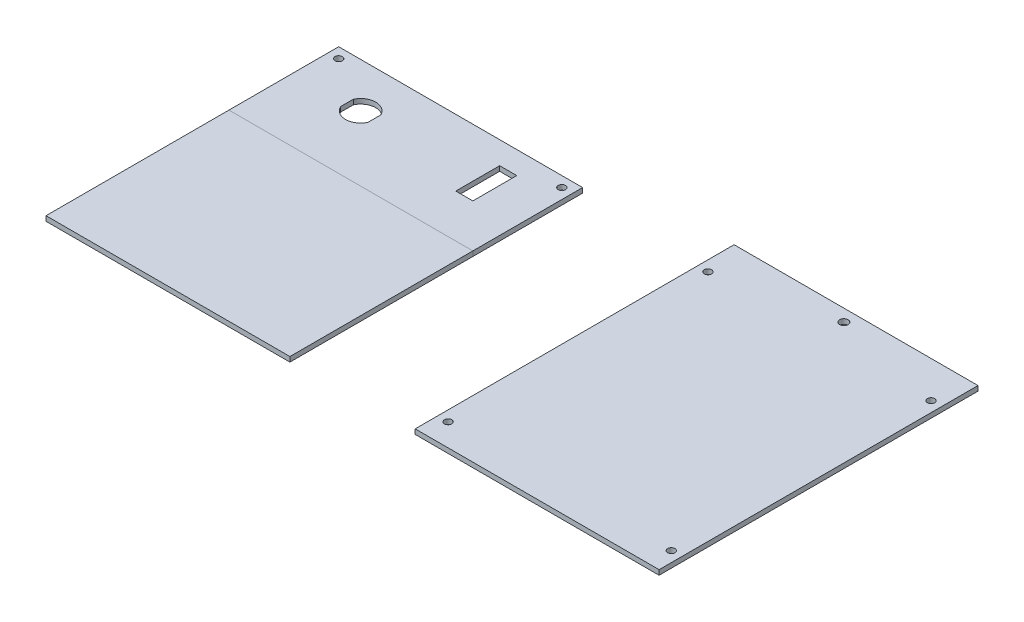
ISO-10303-21;
HEADER;
FILE_DESCRIPTION(('STEP AP214'),'2;1');
FILE_NAME('part.step','',(''),(''),'','','');
FILE_SCHEMA(('AUTOMOTIVE_DESIGN { 1 0 10303 214 1 1 1 1 }'));
ENDSEC;
DATA;
#1=APPLICATION_CONTEXT('core data for automotive mechanical design processes');
#2=APPLICATION_PROTOCOL_DEFINITION('international standard','automotive_design',2000,#1);
#3=PRODUCT_CONTEXT('',#1,'mechanical');
#4=PRODUCT('Part','Part','',(#3));
#5=PRODUCT_RELATED_PRODUCT_CATEGORY('part','',(#4));
#6=PRODUCT_DEFINITION_FORMATION('','',#4);
#7=PRODUCT_DEFINITION_CONTEXT('part definition',#1,'design');
#8=PRODUCT_DEFINITION('design','',#6,#7);
#9=PRODUCT_DEFINITION_SHAPE('','',#8);
#10=(LENGTH_UNIT() NAMED_UNIT(*) SI_UNIT(.MILLI.,.METRE.));
#11=(NAMED_UNIT(*) PLANE_ANGLE_UNIT() SI_UNIT($,.RADIAN.));
#12=(NAMED_UNIT(*) SI_UNIT($,.STERADIAN.) SOLID_ANGLE_UNIT());
#13=UNCERTAINTY_MEASURE_WITH_UNIT(LENGTH_MEASURE(1.E-05),#10,'distance_accuracy_value','');
#14=(GEOMETRIC_REPRESENTATION_CONTEXT(3) GLOBAL_UNCERTAINTY_ASSIGNED_CONTEXT((#13)) GLOBAL_UNIT_ASSIGNED_CONTEXT((#10,
#11,#12)) REPRESENTATION_CONTEXT('',''));
#15=CARTESIAN_POINT('',(0.,0.,0.));
#16=DIRECTION('',(0.,0.,1.));
#17=DIRECTION('',(1.,0.,0.));
#18=AXIS2_PLACEMENT_3D('',#15,#16,#17);
#19=CARTESIAN_POINT('',(100.,2.,0.));
#20=DIRECTION('',(1.,0.,0.));
#21=DIRECTION('',(0.,0.,-1.));
#22=AXIS2_PLACEMENT_3D('',#19,#20,#21);
#23=PLANE('',#22);
#24=DIRECTION('',(0.,0.,1.));
#25=VECTOR('',#24,1.);
#26=CARTESIAN_POINT('',(100.,0.,0.));
#27=LINE('',#26,#25);
#28=CARTESIAN_POINT('',(100.,0.,0.));
#29=VERTEX_POINT('',#28);
#30=CARTESIAN_POINT('',(100.,0.,75.));
#31=VERTEX_POINT('',#30);
#32=EDGE_CURVE('E109',#29,#31,#27,.T.);
#33=ORIENTED_EDGE('',*,*,#32,.F.);
#34=DIRECTION('',(0.,-1.,0.));
#35=VECTOR('',#34,1.);
#36=CARTESIAN_POINT('',(100.,2.,0.));
#37=LINE('',#36,#35);
#38=CARTESIAN_POINT('',(100.,2.,0.));
#39=VERTEX_POINT('',#38);
#40=EDGE_CURVE('E12',#39,#29,#37,.T.);
#41=ORIENTED_EDGE('',*,*,#40,.F.);
#42=DIRECTION('',(0.,0.,1.));
#43=VECTOR('',#42,1.);
#44=CARTESIAN_POINT('',(100.,2.,0.));
#45=LINE('',#44,#43);
#46=CARTESIAN_POINT('',(100.,2.,75.));
#47=VERTEX_POINT('',#46);
#48=EDGE_CURVE('E103',#39,#47,#45,.T.);
#49=ORIENTED_EDGE('',*,*,#48,.T.);
#50=DIRECTION('',(0.,-1.,0.));
#51=VECTOR('',#50,1.);
#52=CARTESIAN_POINT('',(100.,2.,75.));
#53=LINE('',#52,#51);
#54=EDGE_CURVE('E84',#47,#31,#53,.T.);
#55=ORIENTED_EDGE('',*,*,#54,.T.);
#56=EDGE_LOOP('',(#33,#41,#49,#55));
#57=FACE_BOUND('',#56,.T.);
#58=ADVANCED_FACE('F46',(#57),#23,.T.);
#59=CARTESIAN_POINT('',(0.,2.,0.));
#60=DIRECTION('',(0.,0.,-1.));
#61=DIRECTION('',(-1.,0.,0.));
#62=AXIS2_PLACEMENT_3D('',#59,#60,#61);
#63=PLANE('',#62);
#64=DIRECTION('',(1.,0.,0.));
#65=VECTOR('',#64,1.);
#66=CARTESIAN_POINT('',(0.,0.,0.));
#67=LINE('',#66,#65);
#68=CARTESIAN_POINT('',(0.,0.,0.));
#69=VERTEX_POINT('',#68);
#70=EDGE_CURVE('E97',#69,#29,#67,.T.);
#71=ORIENTED_EDGE('',*,*,#70,.F.);
#72=DIRECTION('',(0.,-1.,0.));
#73=VECTOR('',#72,1.);
#74=CARTESIAN_POINT('',(0.,2.,0.));
#75=LINE('',#74,#73);
#76=CARTESIAN_POINT('',(0.,2.,0.));
#77=VERTEX_POINT('',#76);
#78=EDGE_CURVE('E54',#77,#69,#75,.T.);
#79=ORIENTED_EDGE('',*,*,#78,.F.);
#80=DIRECTION('',(1.,0.,0.));
#81=VECTOR('',#80,1.);
#82=CARTESIAN_POINT('',(0.,2.,0.));
#83=LINE('',#82,#81);
#84=EDGE_CURVE('E95',#77,#39,#83,.T.);
#85=ORIENTED_EDGE('',*,*,#84,.T.);
#86=ORIENTED_EDGE('',*,*,#40,.T.);
#87=EDGE_LOOP('',(#71,#79,#85,#86));
#88=FACE_BOUND('',#87,.T.);
#89=ADVANCED_FACE('F93',(#88),#63,.T.);
#90=CARTESIAN_POINT('',(0.,2.,0.));
#91=DIRECTION('',(1.,0.,0.));
#92=DIRECTION('',(0.,0.,-1.));
#93=AXIS2_PLACEMENT_3D('',#90,#91,#92);
#94=PLANE('',#93);
#95=DIRECTION('',(0.,0.,1.));
#96=VECTOR('',#95,1.);
#97=CARTESIAN_POINT('',(0.,0.,0.));
#98=LINE('',#97,#96);
#99=CARTESIAN_POINT('',(0.,0.,75.));
#100=VERTEX_POINT('',#99);
#101=EDGE_CURVE('E77',#69,#100,#98,.T.);
#102=ORIENTED_EDGE('',*,*,#101,.T.);
#103=DIRECTION('',(0.,-1.,0.));
#104=VECTOR('',#103,1.);
#105=CARTESIAN_POINT('',(0.,2.,75.));
#106=LINE('',#105,#104);
#107=CARTESIAN_POINT('',(0.,2.,75.));
#108=VERTEX_POINT('',#107);
#109=EDGE_CURVE('E98',#108,#100,#106,.T.);
#110=ORIENTED_EDGE('',*,*,#109,.F.);
#111=DIRECTION('',(0.,0.,1.));
#112=VECTOR('',#111,1.);
#113=CARTESIAN_POINT('',(0.,2.,0.));
#114=LINE('',#113,#112);
#115=EDGE_CURVE('E99',#77,#108,#114,.T.);
#116=ORIENTED_EDGE('',*,*,#115,.F.);
#117=ORIENTED_EDGE('',*,*,#78,.T.);
#118=EDGE_LOOP('',(#102,#110,#116,#117));
#119=FACE_BOUND('',#118,.T.);
#120=ADVANCED_FACE('F100',(#119),#94,.F.);
#121=CARTESIAN_POINT('',(0.,2.,75.));
#122=DIRECTION('',(0.,0.,-1.));
#123=DIRECTION('',(-1.,0.,0.));
#124=AXIS2_PLACEMENT_3D('',#121,#122,#123);
#125=PLANE('',#124);
#126=DIRECTION('',(1.,0.,0.));
#127=VECTOR('',#126,1.);
#128=CARTESIAN_POINT('',(0.,0.,75.));
#129=LINE('',#128,#127);
#130=EDGE_CURVE('E105',#100,#31,#129,.T.);
#131=ORIENTED_EDGE('',*,*,#130,.T.);
#132=ORIENTED_EDGE('',*,*,#54,.F.);
#133=DIRECTION('',(1.,0.,0.));
#134=VECTOR('',#133,1.);
#135=CARTESIAN_POINT('',(0.,2.,75.));
#136=LINE('',#135,#134);
#137=EDGE_CURVE('E62',#108,#47,#136,.T.);
#138=ORIENTED_EDGE('',*,*,#137,.F.);
#139=ORIENTED_EDGE('',*,*,#109,.T.);
#140=EDGE_LOOP('',(#131,#132,#138,#139));
#141=FACE_BOUND('',#140,.T.);
#142=ADVANCED_FACE('F118',(#141),#125,.F.);
#143=CARTESIAN_POINT('',(0.,2.,0.));
#144=DIRECTION('',(0.,1.,0.));
#145=DIRECTION('',(0.,0.,1.));
#146=AXIS2_PLACEMENT_3D('',#143,#144,#145);
#147=PLANE('',#146);
#148=ORIENTED_EDGE('',*,*,#48,.F.);
#149=ORIENTED_EDGE('',*,*,#84,.F.);
#150=ORIENTED_EDGE('',*,*,#115,.T.);
#151=ORIENTED_EDGE('',*,*,#137,.T.);
#152=EDGE_LOOP('',(#148,#149,#150,#151));
#153=FACE_BOUND('',#152,.T.);
#154=ADVANCED_FACE('F102',(#153),#147,.T.);
#155=CARTESIAN_POINT('',(0.,0.,0.));
#156=DIRECTION('',(0.,1.,0.));
#157=DIRECTION('',(0.,0.,1.));
#158=AXIS2_PLACEMENT_3D('',#155,#156,#157);
#159=PLANE('',#158);
#160=ORIENTED_EDGE('',*,*,#32,.T.);
#161=ORIENTED_EDGE('',*,*,#130,.F.);
#162=ORIENTED_EDGE('',*,*,#101,.F.);
#163=ORIENTED_EDGE('',*,*,#70,.T.);
#164=EDGE_LOOP('',(#160,#161,#162,#163));
#165=FACE_BOUND('',#164,.T.);
#166=ADVANCED_FACE('F120',(#165),#159,.F.);
#167=CLOSED_SHELL('',(#58,#89,#120,#142,#154,#166));
#168=MANIFOLD_SOLID_BREP('B2',#167);
#169=CARTESIAN_POINT('',(0.,2.,-35.75));
#170=DIRECTION('',(0.,0.,-1.));
#171=DIRECTION('',(-1.,0.,0.));
#172=AXIS2_PLACEMENT_3D('',#169,#170,#171);
#173=PLANE('',#172);
#174=DIRECTION('',(1.,0.,0.));
#175=VECTOR('',#174,1.);
#176=CARTESIAN_POINT('',(0.,0.,-35.75));
#177=LINE('',#176,#175);
#178=CARTESIAN_POINT('',(75.25,0.,-35.75));
#179=VERTEX_POINT('',#178);
#180=CARTESIAN_POINT('',(82.25,0.,-35.75));
#181=VERTEX_POINT('',#180);
#182=EDGE_CURVE('E332',#179,#181,#177,.T.);
#183=ORIENTED_EDGE('',*,*,#182,.T.);
#184=DIRECTION('',(0.,-1.,0.));
#185=VECTOR('',#184,1.);
#186=CARTESIAN_POINT('',(82.25,2.,-35.75));
#187=LINE('',#186,#185);
#188=CARTESIAN_POINT('',(82.25,2.,-35.75));
#189=VERTEX_POINT('',#188);
#190=EDGE_CURVE('E44',#189,#181,#187,.T.);
#191=ORIENTED_EDGE('',*,*,#190,.F.);
#192=DIRECTION('',(1.,0.,0.));
#193=VECTOR('',#192,1.);
#194=CARTESIAN_POINT('',(0.,2.,-35.75));
#195=LINE('',#194,#193);
#196=CARTESIAN_POINT('',(75.25,2.,-35.75));
#197=VERTEX_POINT('',#196);
#198=EDGE_CURVE('E285',#197,#189,#195,.T.);
#199=ORIENTED_EDGE('',*,*,#198,.F.);
#200=DIRECTION('',(0.,-1.,0.));
#201=VECTOR('',#200,1.);
#202=CARTESIAN_POINT('',(75.25,2.,-35.75));
#203=LINE('',#202,#201);
#204=EDGE_CURVE('E201',#197,#179,#203,.T.);
#205=ORIENTED_EDGE('',*,*,#204,.T.);
#206=EDGE_LOOP('',(#183,#191,#199,#205));
#207=FACE_BOUND('',#206,.T.);
#208=ADVANCED_FACE('F182',(#207),#173,.F.);
#209=CARTESIAN_POINT('',(82.25,2.,0.));
#210=DIRECTION('',(1.,0.,0.));
#211=DIRECTION('',(0.,0.,-1.));
#212=AXIS2_PLACEMENT_3D('',#209,#210,#211);
#213=PLANE('',#212);
#214=DIRECTION('',(0.,0.,1.));
#215=VECTOR('',#214,1.);
#216=CARTESIAN_POINT('',(82.25,0.,0.));
#217=LINE('',#216,#215);
#218=CARTESIAN_POINT('',(82.25,0.,-17.75));
#219=VERTEX_POINT('',#218);
#220=EDGE_CURVE('E291',#181,#219,#217,.T.);
#221=ORIENTED_EDGE('',*,*,#220,.T.);
#222=DIRECTION('',(0.,-1.,0.));
#223=VECTOR('',#222,1.);
#224=CARTESIAN_POINT('',(82.25,2.,-17.75));
#225=LINE('',#224,#223);
#226=CARTESIAN_POINT('',(82.25,2.,-17.75));
#227=VERTEX_POINT('',#226);
#228=EDGE_CURVE('E192',#227,#219,#225,.T.);
#229=ORIENTED_EDGE('',*,*,#228,.F.);
#230=DIRECTION('',(0.,0.,1.));
#231=VECTOR('',#230,1.);
#232=CARTESIAN_POINT('',(82.25,2.,0.));
#233=LINE('',#232,#231);
#234=EDGE_CURVE('E279',#189,#227,#233,.T.);
#235=ORIENTED_EDGE('',*,*,#234,.F.);
#236=ORIENTED_EDGE('',*,*,#190,.T.);
#237=EDGE_LOOP('',(#221,#229,#235,#236));
#238=FACE_BOUND('',#237,.T.);
#239=ADVANCED_FACE('F290',(#238),#213,.F.);
#240=CARTESIAN_POINT('',(0.,2.,-17.75));
#241=DIRECTION('',(0.,0.,-1.));
#242=DIRECTION('',(-1.,0.,0.));
#243=AXIS2_PLACEMENT_3D('',#240,#241,#242);
#244=PLANE('',#243);
#245=DIRECTION('',(1.,0.,0.));
#246=VECTOR('',#245,1.);
#247=CARTESIAN_POINT('',(0.,0.,-17.75));
#248=LINE('',#247,#246);
#249=CARTESIAN_POINT('',(75.25,0.,-17.75));
#250=VERTEX_POINT('',#249);
#251=EDGE_CURVE('E335',#250,#219,#248,.T.);
#252=ORIENTED_EDGE('',*,*,#251,.F.);
#253=DIRECTION('',(0.,-1.,0.));
#254=VECTOR('',#253,1.);
#255=CARTESIAN_POINT('',(75.25,2.,-17.75));
#256=LINE('',#255,#254);
#257=CARTESIAN_POINT('',(75.25,2.,-17.75));
#258=VERTEX_POINT('',#257);
#259=EDGE_CURVE('E239',#258,#250,#256,.T.);
#260=ORIENTED_EDGE('',*,*,#259,.F.);
#261=DIRECTION('',(1.,0.,0.));
#262=VECTOR('',#261,1.);
#263=CARTESIAN_POINT('',(0.,2.,-17.75));
#264=LINE('',#263,#262);
#265=EDGE_CURVE('E284',#258,#227,#264,.T.);
#266=ORIENTED_EDGE('',*,*,#265,.T.);
#267=ORIENTED_EDGE('',*,*,#228,.T.);
#268=EDGE_LOOP('',(#252,#260,#266,#267));
#269=FACE_BOUND('',#268,.T.);
#270=ADVANCED_FACE('F295',(#269),#244,.T.);
#271=CARTESIAN_POINT('',(0.,2.,0.));
#272=DIRECTION('',(0.,0.,-1.));
#273=DIRECTION('',(-1.,0.,0.));
#274=AXIS2_PLACEMENT_3D('',#271,#272,#273);
#275=PLANE('',#274);
#276=DIRECTION('',(1.,0.,0.));
#277=VECTOR('',#276,1.);
#278=CARTESIAN_POINT('',(0.,0.,0.));
#279=LINE('',#278,#277);
#280=CARTESIAN_POINT('',(0.,0.,0.));
#281=VERTEX_POINT('',#280);
#282=CARTESIAN_POINT('',(100.,0.,0.));
#283=VERTEX_POINT('',#282);
#284=EDGE_CURVE('E320',#281,#283,#279,.T.);
#285=ORIENTED_EDGE('',*,*,#284,.T.);
#286=DIRECTION('',(0.,-1.,0.));
#287=VECTOR('',#286,1.);
#288=CARTESIAN_POINT('',(100.,2.,0.));
#289=LINE('',#288,#287);
#290=CARTESIAN_POINT('',(100.,2.,0.));
#291=VERTEX_POINT('',#290);
#292=EDGE_CURVE('E342',#291,#283,#289,.T.);
#293=ORIENTED_EDGE('',*,*,#292,.F.);
#294=DIRECTION('',(1.,0.,0.));
#295=VECTOR('',#294,1.);
#296=CARTESIAN_POINT('',(0.,2.,0.));
#297=LINE('',#296,#295);
#298=CARTESIAN_POINT('',(0.,2.,0.));
#299=VERTEX_POINT('',#298);
#300=EDGE_CURVE('E528',#299,#291,#297,.T.);
#301=ORIENTED_EDGE('',*,*,#300,.F.);
#302=DIRECTION('',(0.,-1.,0.));
#303=VECTOR('',#302,1.);
#304=CARTESIAN_POINT('',(0.,2.,0.));
#305=LINE('',#304,#303);
#306=EDGE_CURVE('E344',#299,#281,#305,.T.);
#307=ORIENTED_EDGE('',*,*,#306,.T.);
#308=EDGE_LOOP('',(#285,#293,#301,#307));
#309=FACE_BOUND('',#308,.T.);
#310=ADVANCED_FACE('F401',(#309),#275,.F.);
#311=CARTESIAN_POINT('',(100.,2.,0.));
#312=DIRECTION('',(-1.,0.,0.));
#313=DIRECTION('',(0.,0.,1.));
#314=AXIS2_PLACEMENT_3D('',#311,#312,#313);
#315=PLANE('',#314);
#316=DIRECTION('',(0.,0.,-1.));
#317=VECTOR('',#316,1.);
#318=CARTESIAN_POINT('',(100.,0.,0.));
#319=LINE('',#318,#317);
#320=CARTESIAN_POINT('',(100.,0.,-45.));
#321=VERTEX_POINT('',#320);
#322=EDGE_CURVE('E323',#283,#321,#319,.T.);
#323=ORIENTED_EDGE('',*,*,#322,.T.);
#324=DIRECTION('',(0.,-1.,0.));
#325=VECTOR('',#324,1.);
#326=CARTESIAN_POINT('',(100.,2.,-45.));
#327=LINE('',#326,#325);
#328=CARTESIAN_POINT('',(100.,2.,-45.));
#329=VERTEX_POINT('',#328);
#330=EDGE_CURVE('E348',#329,#321,#327,.T.);
#331=ORIENTED_EDGE('',*,*,#330,.F.);
#332=DIRECTION('',(0.,0.,-1.));
#333=VECTOR('',#332,1.);
#334=CARTESIAN_POINT('',(100.,2.,0.));
#335=LINE('',#334,#333);
#336=EDGE_CURVE('E526',#291,#329,#335,.T.);
#337=ORIENTED_EDGE('',*,*,#336,.F.);
#338=ORIENTED_EDGE('',*,*,#292,.T.);
#339=EDGE_LOOP('',(#323,#331,#337,#338));
#340=FACE_BOUND('',#339,.T.);
#341=ADVANCED_FACE('F397',(#340),#315,.F.);
#342=CARTESIAN_POINT('',(0.,2.,-45.));
#343=DIRECTION('',(0.,0.,-1.));
#344=DIRECTION('',(-1.,0.,0.));
#345=AXIS2_PLACEMENT_3D('',#342,#343,#344);
#346=PLANE('',#345);
#347=DIRECTION('',(1.,0.,0.));
#348=VECTOR('',#347,1.);
#349=CARTESIAN_POINT('',(0.,0.,-45.));
#350=LINE('',#349,#348);
#351=CARTESIAN_POINT('',(0.,0.,-45.));
#352=VERTEX_POINT('',#351);
#353=EDGE_CURVE('E326',#352,#321,#350,.T.);
#354=ORIENTED_EDGE('',*,*,#353,.F.);
#355=DIRECTION('',(0.,-1.,0.));
#356=VECTOR('',#355,1.);
#357=CARTESIAN_POINT('',(0.,2.,-45.));
#358=LINE('',#357,#356);
#359=CARTESIAN_POINT('',(0.,2.,-45.));
#360=VERTEX_POINT('',#359);
#361=EDGE_CURVE('E346',#360,#352,#358,.T.);
#362=ORIENTED_EDGE('',*,*,#361,.F.);
#363=DIRECTION('',(1.,0.,0.));
#364=VECTOR('',#363,1.);
#365=CARTESIAN_POINT('',(0.,2.,-45.));
#366=LINE('',#365,#364);
#367=EDGE_CURVE('E521',#360,#329,#366,.T.);
#368=ORIENTED_EDGE('',*,*,#367,.T.);
#369=ORIENTED_EDGE('',*,*,#330,.T.);
#370=EDGE_LOOP('',(#354,#362,#368,#369));
#371=FACE_BOUND('',#370,.T.);
#372=ADVANCED_FACE('F394',(#371),#346,.T.);
#373=CARTESIAN_POINT('',(27.2434372781874,2.,-26.75));
#374=DIRECTION('',(0.,-1.,0.));
#375=DIRECTION('',(0.,0.,-1.));
#376=AXIS2_PLACEMENT_3D('',#373,#374,#375);
#377=CYLINDRICAL_SURFACE('',#376,6.17499999999999);
#378=CARTESIAN_POINT('',(27.2434372781874,0.,-26.75));
#379=DIRECTION('',(0.,1.,0.));
#380=DIRECTION('',(0.,0.,1.));
#381=AXIS2_PLACEMENT_3D('',#378,#379,#380);
#382=CIRCLE('',#381,6.17499999999999);
#383=CARTESIAN_POINT('',(32.8434372781874,0.,-29.3520424669863));
#384=VERTEX_POINT('',#383);
#385=CARTESIAN_POINT('',(21.6434372781875,0.,-29.3520424669863));
#386=VERTEX_POINT('',#385);
#387=EDGE_CURVE('E302',#384,#386,#382,.T.);
#388=ORIENTED_EDGE('',*,*,#387,.F.);
#389=DIRECTION('',(0.,-1.,0.));
#390=VECTOR('',#389,1.);
#391=CARTESIAN_POINT('',(32.8434372781874,2.,-29.3520424669863));
#392=LINE('',#391,#390);
#393=CARTESIAN_POINT('',(32.8434372781874,2.,-29.3520424669863));
#394=VERTEX_POINT('',#393);
#395=EDGE_CURVE('E186',#394,#384,#392,.T.);
#396=ORIENTED_EDGE('',*,*,#395,.F.);
#397=CARTESIAN_POINT('',(27.2434372781874,2.,-26.75));
#398=DIRECTION('',(0.,1.,0.));
#399=DIRECTION('',(0.,0.,1.));
#400=AXIS2_PLACEMENT_3D('',#397,#398,#399);
#401=CIRCLE('',#400,6.17499999999999);
#402=CARTESIAN_POINT('',(21.6434372781875,2.,-29.3520424669863));
#403=VERTEX_POINT('',#402);
#404=EDGE_CURVE('E340',#394,#403,#401,.T.);
#405=ORIENTED_EDGE('',*,*,#404,.T.);
#406=DIRECTION('',(0.,-1.,0.));
#407=VECTOR('',#406,1.);
#408=CARTESIAN_POINT('',(21.6434372781875,2.,-29.3520424669863));
#409=LINE('',#408,#407);
#410=EDGE_CURVE('E298',#403,#386,#409,.T.);
#411=ORIENTED_EDGE('',*,*,#410,.T.);
#412=EDGE_LOOP('',(#388,#396,#405,#411));
#413=FACE_BOUND('',#412,.T.);
#414=ADVANCED_FACE('F184',(#413),#377,.F.);
#415=CARTESIAN_POINT('',(32.8434372781875,2.,0.));
#416=DIRECTION('',(1.,0.,0.));
#417=DIRECTION('',(0.,0.,-1.));
#418=AXIS2_PLACEMENT_3D('',#415,#416,#417);
#419=PLANE('',#418);
#420=DIRECTION('',(0.,0.,1.));
#421=VECTOR('',#420,1.);
#422=CARTESIAN_POINT('',(32.8434372781875,0.,0.));
#423=LINE('',#422,#421);
#424=CARTESIAN_POINT('',(32.8434372781875,0.,-24.1479575330137));
#425=VERTEX_POINT('',#424);
#426=EDGE_CURVE('E305',#384,#425,#423,.T.);
#427=ORIENTED_EDGE('',*,*,#426,.T.);
#428=DIRECTION('',(0.,-1.,0.));
#429=VECTOR('',#428,1.);
#430=CARTESIAN_POINT('',(32.8434372781875,2.,-24.1479575330137));
#431=LINE('',#430,#429);
#432=CARTESIAN_POINT('',(32.8434372781875,2.,-24.1479575330137));
#433=VERTEX_POINT('',#432);
#434=EDGE_CURVE('E354',#433,#425,#431,.T.);
#435=ORIENTED_EDGE('',*,*,#434,.F.);
#436=DIRECTION('',(0.,0.,1.));
#437=VECTOR('',#436,1.);
#438=CARTESIAN_POINT('',(32.8434372781875,2.,0.));
#439=LINE('',#438,#437);
#440=EDGE_CURVE('E362',#394,#433,#439,.T.);
#441=ORIENTED_EDGE('',*,*,#440,.F.);
#442=ORIENTED_EDGE('',*,*,#395,.T.);
#443=EDGE_LOOP('',(#427,#435,#441,#442));
#444=FACE_BOUND('',#443,.T.);
#445=ADVANCED_FACE('F361',(#444),#419,.F.);
#446=CARTESIAN_POINT('',(27.2434372781874,2.,-26.75));
#447=DIRECTION('',(0.,-1.,0.));
#448=DIRECTION('',(0.,0.,-1.));
#449=AXIS2_PLACEMENT_3D('',#446,#447,#448);
#450=CYLINDRICAL_SURFACE('',#449,6.175);
#451=CARTESIAN_POINT('',(27.2434372781874,0.,-26.75));
#452=DIRECTION('',(0.,1.,0.));
#453=DIRECTION('',(0.,0.,1.));
#454=AXIS2_PLACEMENT_3D('',#451,#452,#453);
#455=CIRCLE('',#454,6.175);
#456=CARTESIAN_POINT('',(21.6434372781875,0.,-24.1479575330137));
#457=VERTEX_POINT('',#456);
#458=EDGE_CURVE('E308',#457,#425,#455,.T.);
#459=ORIENTED_EDGE('',*,*,#458,.F.);
#460=DIRECTION('',(0.,-1.,0.));
#461=VECTOR('',#460,1.);
#462=CARTESIAN_POINT('',(21.6434372781875,2.,-24.1479575330137));
#463=LINE('',#462,#461);
#464=CARTESIAN_POINT('',(21.6434372781875,2.,-24.1479575330137));
#465=VERTEX_POINT('',#464);
#466=EDGE_CURVE('E353',#465,#457,#463,.T.);
#467=ORIENTED_EDGE('',*,*,#466,.F.);
#468=CARTESIAN_POINT('',(27.2434372781874,2.,-26.75));
#469=DIRECTION('',(0.,1.,0.));
#470=DIRECTION('',(0.,0.,1.));
#471=AXIS2_PLACEMENT_3D('',#468,#469,#470);
#472=CIRCLE('',#471,6.175);
#473=EDGE_CURVE('E538',#465,#433,#472,.T.);
#474=ORIENTED_EDGE('',*,*,#473,.T.);
#475=ORIENTED_EDGE('',*,*,#434,.T.);
#476=EDGE_LOOP('',(#459,#467,#474,#475));
#477=FACE_BOUND('',#476,.T.);
#478=ADVANCED_FACE('F374',(#477),#450,.F.);
#479=CARTESIAN_POINT('',(0.,2.,0.));
#480=DIRECTION('',(-1.,0.,0.));
#481=DIRECTION('',(0.,0.,1.));
#482=AXIS2_PLACEMENT_3D('',#479,#480,#481);
#483=PLANE('',#482);
#484=DIRECTION('',(0.,0.,-1.));
#485=VECTOR('',#484,1.);
#486=CARTESIAN_POINT('',(0.,0.,0.));
#487=LINE('',#486,#485);
#488=EDGE_CURVE('E329',#281,#352,#487,.T.);
#489=ORIENTED_EDGE('',*,*,#488,.F.);
#490=ORIENTED_EDGE('',*,*,#306,.F.);
#491=DIRECTION('',(0.,0.,-1.));
#492=VECTOR('',#491,1.);
#493=CARTESIAN_POINT('',(0.,2.,0.));
#494=LINE('',#493,#492);
#495=EDGE_CURVE('E519',#299,#360,#494,.T.);
#496=ORIENTED_EDGE('',*,*,#495,.T.);
#497=ORIENTED_EDGE('',*,*,#361,.T.);
#498=EDGE_LOOP('',(#489,#490,#496,#497));
#499=FACE_BOUND('',#498,.T.);
#500=ADVANCED_FACE('F376',(#499),#483,.T.);
#501=CARTESIAN_POINT('',(4.25,2.,-40.75));
#502=DIRECTION('',(0.,-1.,0.));
#503=DIRECTION('',(0.,0.,-1.));
#504=AXIS2_PLACEMENT_3D('',#501,#502,#503);
#505=CYLINDRICAL_SURFACE('',#504,1.5);
#506=CARTESIAN_POINT('',(4.25,2.,-40.75));
#507=DIRECTION('',(0.,1.,0.));
#508=DIRECTION('',(0.,0.,1.));
#509=AXIS2_PLACEMENT_3D('',#506,#507,#508);
#510=CIRCLE('',#509,1.5);
#511=CARTESIAN_POINT('',(4.25,2.,-39.25));
#512=VERTEX_POINT('',#511);
#513=EDGE_CURVE('E531',#512,#512,#510,.T.);
#514=ORIENTED_EDGE('',*,*,#513,.T.);
#515=EDGE_LOOP('',(#514));
#516=FACE_BOUND('',#515,.T.);
#517=CARTESIAN_POINT('',(4.25,0.,-40.75));
#518=DIRECTION('',(0.,1.,0.));
#519=DIRECTION('',(0.,0.,1.));
#520=AXIS2_PLACEMENT_3D('',#517,#518,#519);
#521=CIRCLE('',#520,1.5);
#522=CARTESIAN_POINT('',(4.25,0.,-39.25));
#523=VERTEX_POINT('',#522);
#524=EDGE_CURVE('E317',#523,#523,#521,.T.);
#525=ORIENTED_EDGE('',*,*,#524,.F.);
#526=EDGE_LOOP('',(#525));
#527=FACE_BOUND('',#526,.T.);
#528=ADVANCED_FACE('F382',(#516,#527),#505,.F.);
#529=CARTESIAN_POINT('',(95.75,2.,-40.75));
#530=DIRECTION('',(0.,-1.,0.));
#531=DIRECTION('',(0.,0.,-1.));
#532=AXIS2_PLACEMENT_3D('',#529,#530,#531);
#533=CYLINDRICAL_SURFACE('',#532,1.5);
#534=CARTESIAN_POINT('',(95.75,2.,-40.75));
#535=DIRECTION('',(0.,1.,0.));
#536=DIRECTION('',(0.,0.,1.));
#537=AXIS2_PLACEMENT_3D('',#534,#535,#536);
#538=CIRCLE('',#537,1.5);
#539=CARTESIAN_POINT('',(95.75,2.,-39.25));
#540=VERTEX_POINT('',#539);
#541=EDGE_CURVE('E534',#540,#540,#538,.T.);
#542=ORIENTED_EDGE('',*,*,#541,.T.);
#543=EDGE_LOOP('',(#542));
#544=FACE_BOUND('',#543,.T.);
#545=CARTESIAN_POINT('',(95.75,0.,-40.75));
#546=DIRECTION('',(0.,1.,0.));
#547=DIRECTION('',(0.,0.,1.));
#548=AXIS2_PLACEMENT_3D('',#545,#546,#547);
#549=CIRCLE('',#548,1.5);
#550=CARTESIAN_POINT('',(95.75,0.,-39.25));
#551=VERTEX_POINT('',#550);
#552=EDGE_CURVE('E314',#551,#551,#549,.T.);
#553=ORIENTED_EDGE('',*,*,#552,.F.);
#554=EDGE_LOOP('',(#553));
#555=FACE_BOUND('',#554,.T.);
#556=ADVANCED_FACE('F408',(#544,#555),#533,.F.);
#557=CARTESIAN_POINT('',(21.6434372781875,2.,0.));
#558=DIRECTION('',(1.,0.,0.));
#559=DIRECTION('',(0.,0.,-1.));
#560=AXIS2_PLACEMENT_3D('',#557,#558,#559);
#561=PLANE('',#560);
#562=DIRECTION('',(0.,0.,1.));
#563=VECTOR('',#562,1.);
#564=CARTESIAN_POINT('',(21.6434372781875,0.,0.));
#565=LINE('',#564,#563);
#566=EDGE_CURVE('E311',#386,#457,#565,.T.);
#567=ORIENTED_EDGE('',*,*,#566,.F.);
#568=ORIENTED_EDGE('',*,*,#410,.F.);
#569=DIRECTION('',(0.,0.,1.));
#570=VECTOR('',#569,1.);
#571=CARTESIAN_POINT('',(21.6434372781875,2.,0.));
#572=LINE('',#571,#570);
#573=EDGE_CURVE('E372',#403,#465,#572,.T.);
#574=ORIENTED_EDGE('',*,*,#573,.T.);
#575=ORIENTED_EDGE('',*,*,#466,.T.);
#576=EDGE_LOOP('',(#567,#568,#574,#575));
#577=FACE_BOUND('',#576,.T.);
#578=ADVANCED_FACE('F371',(#577),#561,.T.);
#579=CARTESIAN_POINT('',(75.25,2.,0.));
#580=DIRECTION('',(1.,0.,0.));
#581=DIRECTION('',(0.,0.,-1.));
#582=AXIS2_PLACEMENT_3D('',#579,#580,#581);
#583=PLANE('',#582);
#584=DIRECTION('',(0.,0.,1.));
#585=VECTOR('',#584,1.);
#586=CARTESIAN_POINT('',(75.25,0.,0.));
#587=LINE('',#586,#585);
#588=EDGE_CURVE('E337',#179,#250,#587,.T.);
#589=ORIENTED_EDGE('',*,*,#588,.F.);
#590=ORIENTED_EDGE('',*,*,#204,.F.);
#591=DIRECTION('',(0.,0.,1.));
#592=VECTOR('',#591,1.);
#593=CARTESIAN_POINT('',(75.25,2.,0.));
#594=LINE('',#593,#592);
#595=EDGE_CURVE('E296',#197,#258,#594,.T.);
#596=ORIENTED_EDGE('',*,*,#595,.T.);
#597=ORIENTED_EDGE('',*,*,#259,.T.);
#598=EDGE_LOOP('',(#589,#590,#596,#597));
#599=FACE_BOUND('',#598,.T.);
#600=ADVANCED_FACE('F413',(#599),#583,.T.);
#601=CARTESIAN_POINT('',(0.,2.,0.));
#602=DIRECTION('',(0.,1.,0.));
#603=DIRECTION('',(0.,0.,1.));
#604=AXIS2_PLACEMENT_3D('',#601,#602,#603);
#605=PLANE('',#604);
#606=ORIENTED_EDGE('',*,*,#404,.F.);
#607=ORIENTED_EDGE('',*,*,#440,.T.);
#608=ORIENTED_EDGE('',*,*,#473,.F.);
#609=ORIENTED_EDGE('',*,*,#573,.F.);
#610=EDGE_LOOP('',(#606,#607,#608,#609));
#611=FACE_BOUND('',#610,.T.);
#612=ORIENTED_EDGE('',*,*,#541,.F.);
#613=EDGE_LOOP('',(#612));
#614=FACE_BOUND('',#613,.T.);
#615=ORIENTED_EDGE('',*,*,#513,.F.);
#616=EDGE_LOOP('',(#615));
#617=FACE_BOUND('',#616,.T.);
#618=ORIENTED_EDGE('',*,*,#300,.T.);
#619=ORIENTED_EDGE('',*,*,#336,.T.);
#620=ORIENTED_EDGE('',*,*,#367,.F.);
#621=ORIENTED_EDGE('',*,*,#495,.F.);
#622=EDGE_LOOP('',(#618,#619,#620,#621));
#623=FACE_BOUND('',#622,.T.);
#624=ORIENTED_EDGE('',*,*,#198,.T.);
#625=ORIENTED_EDGE('',*,*,#234,.T.);
#626=ORIENTED_EDGE('',*,*,#265,.F.);
#627=ORIENTED_EDGE('',*,*,#595,.F.);
#628=EDGE_LOOP('',(#624,#625,#626,#627));
#629=FACE_BOUND('',#628,.T.);
#630=ADVANCED_FACE('F281',(#611,#614,#617,#623,#629),#605,.T.);
#631=CARTESIAN_POINT('',(0.,0.,0.));
#632=DIRECTION('',(0.,1.,0.));
#633=DIRECTION('',(0.,0.,1.));
#634=AXIS2_PLACEMENT_3D('',#631,#632,#633);
#635=PLANE('',#634);
#636=ORIENTED_EDGE('',*,*,#387,.T.);
#637=ORIENTED_EDGE('',*,*,#566,.T.);
#638=ORIENTED_EDGE('',*,*,#458,.T.);
#639=ORIENTED_EDGE('',*,*,#426,.F.);
#640=EDGE_LOOP('',(#636,#637,#638,#639));
#641=FACE_BOUND('',#640,.T.);
#642=ORIENTED_EDGE('',*,*,#552,.T.);
#643=EDGE_LOOP('',(#642));
#644=FACE_BOUND('',#643,.T.);
#645=ORIENTED_EDGE('',*,*,#524,.T.);
#646=EDGE_LOOP('',(#645));
#647=FACE_BOUND('',#646,.T.);
#648=ORIENTED_EDGE('',*,*,#284,.F.);
#649=ORIENTED_EDGE('',*,*,#488,.T.);
#650=ORIENTED_EDGE('',*,*,#353,.T.);
#651=ORIENTED_EDGE('',*,*,#322,.F.);
#652=EDGE_LOOP('',(#648,#649,#650,#651));
#653=FACE_BOUND('',#652,.T.);
#654=ORIENTED_EDGE('',*,*,#182,.F.);
#655=ORIENTED_EDGE('',*,*,#588,.T.);
#656=ORIENTED_EDGE('',*,*,#251,.T.);
#657=ORIENTED_EDGE('',*,*,#220,.F.);
#658=EDGE_LOOP('',(#654,#655,#656,#657));
#659=FACE_BOUND('',#658,.T.);
#660=ADVANCED_FACE('F365',(#641,#644,#647,#653,#659),#635,.F.);
#661=CLOSED_SHELL('',(#208,#239,#270,#310,#341,#372,#414,#445,#478,#500,#528,#556,#578,#600,
#630,#660));
#662=MANIFOLD_SOLID_BREP('B6',#661);
#663=CARTESIAN_POINT('',(0.,2.,75.));
#664=DIRECTION('',(0.,0.,-1.));
#665=DIRECTION('',(-1.,0.,0.));
#666=AXIS2_PLACEMENT_3D('',#663,#664,#665);
#667=PLANE('',#666);
#668=DIRECTION('',(1.,0.,0.));
#669=VECTOR('',#668,1.);
#670=CARTESIAN_POINT('',(0.,0.,75.));
#671=LINE('',#670,#669);
#672=CARTESIAN_POINT('',(151.354291092224,0.,75.));
#673=VERTEX_POINT('',#672);
#674=CARTESIAN_POINT('',(251.354291092224,0.,75.));
#675=VERTEX_POINT('',#674);
#676=EDGE_CURVE('E642',#673,#675,#671,.T.);
#677=ORIENTED_EDGE('',*,*,#676,.T.);
#678=DIRECTION('',(0.,-1.,0.));
#679=VECTOR('',#678,1.);
#680=CARTESIAN_POINT('',(251.354291092224,2.,75.));
#681=LINE('',#680,#679);
#682=CARTESIAN_POINT('',(251.354291092224,2.,75.));
#683=VERTEX_POINT('',#682);
#684=EDGE_CURVE('E180',#683,#675,#681,.T.);
#685=ORIENTED_EDGE('',*,*,#684,.F.);
#686=DIRECTION('',(1.,0.,0.));
#687=VECTOR('',#686,1.);
#688=CARTESIAN_POINT('',(0.,2.,75.));
#689=LINE('',#688,#687);
#690=CARTESIAN_POINT('',(151.354291092224,2.,75.));
#691=VERTEX_POINT('',#690);
#692=EDGE_CURVE('E613',#691,#683,#689,.T.);
#693=ORIENTED_EDGE('',*,*,#692,.F.);
#694=DIRECTION('',(0.,-1.,0.));
#695=VECTOR('',#694,1.);
#696=CARTESIAN_POINT('',(151.354291092224,2.,75.));
#697=LINE('',#696,#695);
#698=EDGE_CURVE('E580',#691,#673,#697,.T.);
#699=ORIENTED_EDGE('',*,*,#698,.T.);
#700=EDGE_LOOP('',(#677,#685,#693,#699));
#701=FACE_BOUND('',#700,.T.);
#702=ADVANCED_FACE('F563',(#701),#667,.F.);
#703=CARTESIAN_POINT('',(251.354291092224,2.,0.));
#704=DIRECTION('',(-1.,0.,0.));
#705=DIRECTION('',(0.,0.,1.));
#706=AXIS2_PLACEMENT_3D('',#703,#704,#705);
#707=PLANE('',#706);
#708=DIRECTION('',(0.,0.,-1.));
#709=VECTOR('',#708,1.);
#710=CARTESIAN_POINT('',(251.354291092224,0.,0.));
#711=LINE('',#710,#709);
#712=CARTESIAN_POINT('',(251.354291092224,0.,-55.75));
#713=VERTEX_POINT('',#712);
#714=EDGE_CURVE('E618',#675,#713,#711,.T.);
#715=ORIENTED_EDGE('',*,*,#714,.T.);
#716=DIRECTION('',(0.,-1.,0.));
#717=VECTOR('',#716,1.);
#718=CARTESIAN_POINT('',(251.354291092224,2.,-55.75));
#719=LINE('',#718,#717);
#720=CARTESIAN_POINT('',(251.354291092224,2.,-55.75));
#721=VERTEX_POINT('',#720);
#722=EDGE_CURVE('E572',#721,#713,#719,.T.);
#723=ORIENTED_EDGE('',*,*,#722,.F.);
#724=DIRECTION('',(0.,0.,-1.));
#725=VECTOR('',#724,1.);
#726=CARTESIAN_POINT('',(251.354291092224,2.,0.));
#727=LINE('',#726,#725);
#728=EDGE_CURVE('E605',#683,#721,#727,.T.);
#729=ORIENTED_EDGE('',*,*,#728,.F.);
#730=ORIENTED_EDGE('',*,*,#684,.T.);
#731=EDGE_LOOP('',(#715,#723,#729,#730));
#732=FACE_BOUND('',#731,.T.);
#733=ADVANCED_FACE('F617',(#732),#707,.F.);
#734=CARTESIAN_POINT('',(0.,2.,-55.75));
#735=DIRECTION('',(0.,0.,-1.));
#736=DIRECTION('',(-1.,0.,0.));
#737=AXIS2_PLACEMENT_3D('',#734,#735,#736);
#738=PLANE('',#737);
#739=DIRECTION('',(1.,0.,0.));
#740=VECTOR('',#739,1.);
#741=CARTESIAN_POINT('',(0.,0.,-55.75));
#742=LINE('',#741,#740);
#743=CARTESIAN_POINT('',(151.354291092224,0.,-55.75));
#744=VERTEX_POINT('',#743);
#745=EDGE_CURVE('E645',#744,#713,#742,.T.);
#746=ORIENTED_EDGE('',*,*,#745,.F.);
#747=DIRECTION('',(0.,-1.,0.));
#748=VECTOR('',#747,1.);
#749=CARTESIAN_POINT('',(151.354291092224,2.,-55.75));
#750=LINE('',#749,#748);
#751=CARTESIAN_POINT('',(151.354291092224,2.,-55.75));
#752=VERTEX_POINT('',#751);
#753=EDGE_CURVE('E594',#752,#744,#750,.T.);
#754=ORIENTED_EDGE('',*,*,#753,.F.);
#755=DIRECTION('',(1.,0.,0.));
#756=VECTOR('',#755,1.);
#757=CARTESIAN_POINT('',(0.,2.,-55.75));
#758=LINE('',#757,#756);
#759=EDGE_CURVE('E612',#752,#721,#758,.T.);
#760=ORIENTED_EDGE('',*,*,#759,.T.);
#761=ORIENTED_EDGE('',*,*,#722,.T.);
#762=EDGE_LOOP('',(#746,#754,#760,#761));
#763=FACE_BOUND('',#762,.T.);
#764=ADVANCED_FACE('F621',(#763),#738,.T.);
#765=CARTESIAN_POINT('',(155.604291092224,2.,-40.75));
#766=DIRECTION('',(0.,-1.,0.));
#767=DIRECTION('',(0.,0.,-1.));
#768=AXIS2_PLACEMENT_3D('',#765,#766,#767);
#769=CYLINDRICAL_SURFACE('',#768,1.5);
#770=CARTESIAN_POINT('',(155.604291092224,2.,-40.75));
#771=DIRECTION('',(0.,1.,0.));
#772=DIRECTION('',(0.,0.,1.));
#773=AXIS2_PLACEMENT_3D('',#770,#771,#772);
#774=CIRCLE('',#773,1.5);
#775=CARTESIAN_POINT('',(155.604291092224,2.,-39.25));
#776=VERTEX_POINT('',#775);
#777=EDGE_CURVE('E667',#776,#776,#774,.T.);
#778=ORIENTED_EDGE('',*,*,#777,.T.);
#779=EDGE_LOOP('',(#778));
#780=FACE_BOUND('',#779,.T.);
#781=CARTESIAN_POINT('',(155.604291092224,0.,-40.75));
#782=DIRECTION('',(0.,1.,0.));
#783=DIRECTION('',(0.,0.,1.));
#784=AXIS2_PLACEMENT_3D('',#781,#782,#783);
#785=CIRCLE('',#784,1.5);
#786=CARTESIAN_POINT('',(155.604291092224,0.,-39.25));
#787=VERTEX_POINT('',#786);
#788=EDGE_CURVE('E639',#787,#787,#785,.T.);
#789=ORIENTED_EDGE('',*,*,#788,.F.);
#790=EDGE_LOOP('',(#789));
#791=FACE_BOUND('',#790,.T.);
#792=ADVANCED_FACE('F671',(#780,#791),#769,.F.);
#793=CARTESIAN_POINT('',(247.104291092224,2.,-40.75));
#794=DIRECTION('',(0.,-1.,0.));
#795=DIRECTION('',(0.,0.,-1.));
#796=AXIS2_PLACEMENT_3D('',#793,#794,#795);
#797=CYLINDRICAL_SURFACE('',#796,1.50000000000003);
#798=CARTESIAN_POINT('',(247.104291092224,2.,-40.75));
#799=DIRECTION('',(0.,1.,0.));
#800=DIRECTION('',(0.,0.,1.));
#801=AXIS2_PLACEMENT_3D('',#798,#799,#800);
#802=CIRCLE('',#801,1.50000000000003);
#803=CARTESIAN_POINT('',(247.104291092224,2.,-39.25));
#804=VERTEX_POINT('',#803);
#805=EDGE_CURVE('E664',#804,#804,#802,.T.);
#806=ORIENTED_EDGE('',*,*,#805,.T.);
#807=EDGE_LOOP('',(#806));
#808=FACE_BOUND('',#807,.T.);
#809=CARTESIAN_POINT('',(247.104291092224,0.,-40.75));
#810=DIRECTION('',(0.,1.,0.));
#811=DIRECTION('',(0.,0.,1.));
#812=AXIS2_PLACEMENT_3D('',#809,#810,#811);
#813=CIRCLE('',#812,1.50000000000003);
#814=CARTESIAN_POINT('',(247.104291092224,0.,-39.25));
#815=VERTEX_POINT('',#814);
#816=EDGE_CURVE('E636',#815,#815,#813,.T.);
#817=ORIENTED_EDGE('',*,*,#816,.F.);
#818=EDGE_LOOP('',(#817));
#819=FACE_BOUND('',#818,.T.);
#820=ADVANCED_FACE('F697',(#808,#819),#797,.F.);
#821=CARTESIAN_POINT('',(247.104291092224,2.,65.75));
#822=DIRECTION('',(0.,-1.,0.));
#823=DIRECTION('',(0.,0.,-1.));
#824=AXIS2_PLACEMENT_3D('',#821,#822,#823);
#825=CYLINDRICAL_SURFACE('',#824,1.50000000000003);
#826=CARTESIAN_POINT('',(247.104291092224,2.,65.75));
#827=DIRECTION('',(0.,1.,0.));
#828=DIRECTION('',(0.,0.,1.));
#829=AXIS2_PLACEMENT_3D('',#826,#827,#828);
#830=CIRCLE('',#829,1.50000000000003);
#831=CARTESIAN_POINT('',(247.104291092224,2.,67.25));
#832=VERTEX_POINT('',#831);
#833=EDGE_CURVE('E659',#832,#832,#830,.T.);
#834=ORIENTED_EDGE('',*,*,#833,.T.);
#835=EDGE_LOOP('',(#834));
#836=FACE_BOUND('',#835,.T.);
#837=CARTESIAN_POINT('',(247.104291092224,0.,65.75));
#838=DIRECTION('',(0.,1.,0.));
#839=DIRECTION('',(0.,0.,1.));
#840=AXIS2_PLACEMENT_3D('',#837,#838,#839);
#841=CIRCLE('',#840,1.50000000000003);
#842=CARTESIAN_POINT('',(247.104291092224,0.,67.25));
#843=VERTEX_POINT('',#842);
#844=EDGE_CURVE('E633',#843,#843,#841,.T.);
#845=ORIENTED_EDGE('',*,*,#844,.F.);
#846=EDGE_LOOP('',(#845));
#847=FACE_BOUND('',#846,.T.);
#848=ADVANCED_FACE('F700',(#836,#847),#825,.F.);
#849=CARTESIAN_POINT('',(155.604291092224,2.,65.75));
#850=DIRECTION('',(0.,-1.,0.));
#851=DIRECTION('',(0.,0.,-1.));
#852=AXIS2_PLACEMENT_3D('',#849,#850,#851);
#853=CYLINDRICAL_SURFACE('',#852,1.5);
#854=CARTESIAN_POINT('',(155.604291092224,2.,65.75));
#855=DIRECTION('',(0.,1.,0.));
#856=DIRECTION('',(0.,0.,1.));
#857=AXIS2_PLACEMENT_3D('',#854,#855,#856);
#858=CIRCLE('',#857,1.5);
#859=CARTESIAN_POINT('',(155.604291092224,2.,67.25));
#860=VERTEX_POINT('',#859);
#861=EDGE_CURVE('E654',#860,#860,#858,.T.);
#862=ORIENTED_EDGE('',*,*,#861,.T.);
#863=EDGE_LOOP('',(#862));
#864=FACE_BOUND('',#863,.T.);
#865=CARTESIAN_POINT('',(155.604291092224,0.,65.75));
#866=DIRECTION('',(0.,1.,0.));
#867=DIRECTION('',(0.,0.,1.));
#868=AXIS2_PLACEMENT_3D('',#865,#866,#867);
#869=CIRCLE('',#868,1.5);
#870=CARTESIAN_POINT('',(155.604291092224,0.,67.25));
#871=VERTEX_POINT('',#870);
#872=EDGE_CURVE('E630',#871,#871,#869,.T.);
#873=ORIENTED_EDGE('',*,*,#872,.F.);
#874=EDGE_LOOP('',(#873));
#875=FACE_BOUND('',#874,.T.);
#876=ADVANCED_FACE('F703',(#864,#875),#853,.F.);
#877=CARTESIAN_POINT('',(201.354291092224,2.,-50.75));
#878=DIRECTION('',(0.,-1.,0.));
#879=DIRECTION('',(0.,0.,-1.));
#880=AXIS2_PLACEMENT_3D('',#877,#878,#879);
#881=CYLINDRICAL_SURFACE('',#880,1.75000000000001);
#882=CARTESIAN_POINT('',(201.354291092224,2.,-50.75));
#883=DIRECTION('',(0.,1.,0.));
#884=DIRECTION('',(0.,0.,1.));
#885=AXIS2_PLACEMENT_3D('',#882,#883,#884);
#886=CIRCLE('',#885,1.75000000000001);
#887=CARTESIAN_POINT('',(201.354291092224,2.,-49.));
#888=VERTEX_POINT('',#887);
#889=EDGE_CURVE('E650',#888,#888,#886,.T.);
#890=ORIENTED_EDGE('',*,*,#889,.T.);
#891=EDGE_LOOP('',(#890));
#892=FACE_BOUND('',#891,.T.);
#893=CARTESIAN_POINT('',(201.354291092224,0.,-50.75));
#894=DIRECTION('',(0.,1.,0.));
#895=DIRECTION('',(0.,0.,1.));
#896=AXIS2_PLACEMENT_3D('',#893,#894,#895);
#897=CIRCLE('',#896,1.75000000000001);
#898=CARTESIAN_POINT('',(201.354291092224,0.,-49.));
#899=VERTEX_POINT('',#898);
#900=EDGE_CURVE('E627',#899,#899,#897,.T.);
#901=ORIENTED_EDGE('',*,*,#900,.F.);
#902=EDGE_LOOP('',(#901));
#903=FACE_BOUND('',#902,.T.);
#904=ADVANCED_FACE('F565',(#892,#903),#881,.F.);
#905=CARTESIAN_POINT('',(151.354291092224,2.,0.));
#906=DIRECTION('',(-1.,0.,0.));
#907=DIRECTION('',(0.,0.,1.));
#908=AXIS2_PLACEMENT_3D('',#905,#906,#907);
#909=PLANE('',#908);
#910=DIRECTION('',(0.,0.,-1.));
#911=VECTOR('',#910,1.);
#912=CARTESIAN_POINT('',(151.354291092224,0.,0.));
#913=LINE('',#912,#911);
#914=EDGE_CURVE('E647',#673,#744,#913,.T.);
#915=ORIENTED_EDGE('',*,*,#914,.F.);
#916=ORIENTED_EDGE('',*,*,#698,.F.);
#917=DIRECTION('',(0.,0.,-1.));
#918=VECTOR('',#917,1.);
#919=CARTESIAN_POINT('',(151.354291092224,2.,0.));
#920=LINE('',#919,#918);
#921=EDGE_CURVE('E622',#691,#752,#920,.T.);
#922=ORIENTED_EDGE('',*,*,#921,.T.);
#923=ORIENTED_EDGE('',*,*,#753,.T.);
#924=EDGE_LOOP('',(#915,#916,#922,#923));
#925=FACE_BOUND('',#924,.T.);
#926=ADVANCED_FACE('F676',(#925),#909,.T.);
#927=CARTESIAN_POINT('',(0.,2.,0.));
#928=DIRECTION('',(0.,1.,0.));
#929=DIRECTION('',(0.,0.,1.));
#930=AXIS2_PLACEMENT_3D('',#927,#928,#929);
#931=PLANE('',#930);
#932=ORIENTED_EDGE('',*,*,#889,.F.);
#933=EDGE_LOOP('',(#932));
#934=FACE_BOUND('',#933,.T.);
#935=ORIENTED_EDGE('',*,*,#861,.F.);
#936=EDGE_LOOP('',(#935));
#937=FACE_BOUND('',#936,.T.);
#938=ORIENTED_EDGE('',*,*,#833,.F.);
#939=EDGE_LOOP('',(#938));
#940=FACE_BOUND('',#939,.T.);
#941=ORIENTED_EDGE('',*,*,#805,.F.);
#942=EDGE_LOOP('',(#941));
#943=FACE_BOUND('',#942,.T.);
#944=ORIENTED_EDGE('',*,*,#777,.F.);
#945=EDGE_LOOP('',(#944));
#946=FACE_BOUND('',#945,.T.);
#947=ORIENTED_EDGE('',*,*,#692,.T.);
#948=ORIENTED_EDGE('',*,*,#728,.T.);
#949=ORIENTED_EDGE('',*,*,#759,.F.);
#950=ORIENTED_EDGE('',*,*,#921,.F.);
#951=EDGE_LOOP('',(#947,#948,#949,#950));
#952=FACE_BOUND('',#951,.T.);
#953=ADVANCED_FACE('F609',(#934,#937,#940,#943,#946,#952),#931,.T.);
#954=CARTESIAN_POINT('',(0.,0.,0.));
#955=DIRECTION('',(0.,1.,0.));
#956=DIRECTION('',(0.,0.,1.));
#957=AXIS2_PLACEMENT_3D('',#954,#955,#956);
#958=PLANE('',#957);
#959=ORIENTED_EDGE('',*,*,#900,.T.);
#960=EDGE_LOOP('',(#959));
#961=FACE_BOUND('',#960,.T.);
#962=ORIENTED_EDGE('',*,*,#872,.T.);
#963=EDGE_LOOP('',(#962));
#964=FACE_BOUND('',#963,.T.);
#965=ORIENTED_EDGE('',*,*,#844,.T.);
#966=EDGE_LOOP('',(#965));
#967=FACE_BOUND('',#966,.T.);
#968=ORIENTED_EDGE('',*,*,#816,.T.);
#969=EDGE_LOOP('',(#968));
#970=FACE_BOUND('',#969,.T.);
#971=ORIENTED_EDGE('',*,*,#788,.T.);
#972=EDGE_LOOP('',(#971));
#973=FACE_BOUND('',#972,.T.);
#974=ORIENTED_EDGE('',*,*,#676,.F.);
#975=ORIENTED_EDGE('',*,*,#914,.T.);
#976=ORIENTED_EDGE('',*,*,#745,.T.);
#977=ORIENTED_EDGE('',*,*,#714,.F.);
#978=EDGE_LOOP('',(#974,#975,#976,#977));
#979=FACE_BOUND('',#978,.T.);
#980=ADVANCED_FACE('F675',(#961,#964,#967,#970,#973,#979),#958,.F.);
#981=CLOSED_SHELL('',(#702,#733,#764,#792,#820,#848,#876,#904,#926,#953,#980));
#982=MANIFOLD_SOLID_BREP('B38',#981);
#983=ADVANCED_BREP_SHAPE_REPRESENTATION('',(#18,#168,#662,#982),#14);
#984=SHAPE_DEFINITION_REPRESENTATION(#9,#983);
ENDSEC;
END-ISO-10303-21;
